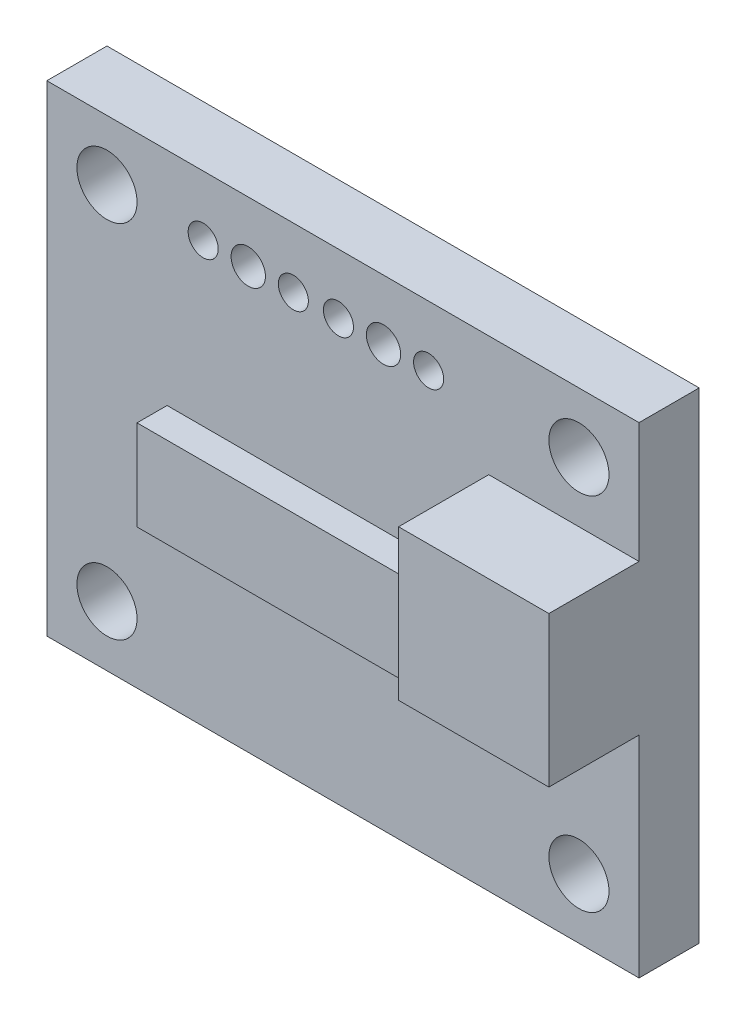
ISO-10303-21;
HEADER;
FILE_DESCRIPTION(('STEP AP214'),'2;1');
FILE_NAME('part.step','',(''),(''),'','','');
FILE_SCHEMA(('AUTOMOTIVE_DESIGN { 1 0 10303 214 1 1 1 1 }'));
ENDSEC;
DATA;
#1=APPLICATION_CONTEXT('core data for automotive mechanical design processes');
#2=APPLICATION_PROTOCOL_DEFINITION('international standard','automotive_design',2000,#1);
#3=PRODUCT_CONTEXT('',#1,'mechanical');
#4=PRODUCT('Part','Part','',(#3));
#5=PRODUCT_RELATED_PRODUCT_CATEGORY('part','',(#4));
#6=PRODUCT_DEFINITION_FORMATION('','',#4);
#7=PRODUCT_DEFINITION_CONTEXT('part definition',#1,'design');
#8=PRODUCT_DEFINITION('design','',#6,#7);
#9=PRODUCT_DEFINITION_SHAPE('','',#8);
#10=(LENGTH_UNIT() NAMED_UNIT(*) SI_UNIT(.MILLI.,.METRE.));
#11=(NAMED_UNIT(*) PLANE_ANGLE_UNIT() SI_UNIT($,.RADIAN.));
#12=(NAMED_UNIT(*) SI_UNIT($,.STERADIAN.) SOLID_ANGLE_UNIT());
#13=UNCERTAINTY_MEASURE_WITH_UNIT(LENGTH_MEASURE(1.E-05),#10,'distance_accuracy_value','');
#14=(GEOMETRIC_REPRESENTATION_CONTEXT(3) GLOBAL_UNCERTAINTY_ASSIGNED_CONTEXT((#13)) GLOBAL_UNIT_ASSIGNED_CONTEXT((#10,
#11,#12)) REPRESENTATION_CONTEXT('',''));
#15=CARTESIAN_POINT('',(0.,0.,0.));
#16=DIRECTION('',(0.,0.,1.));
#17=DIRECTION('',(1.,0.,0.));
#18=AXIS2_PLACEMENT_3D('',#15,#16,#17);
#19=CARTESIAN_POINT('',(0.,7.35633001007277,2.));
#20=DIRECTION('',(0.,-1.,0.));
#21=DIRECTION('',(1.,0.,0.));
#22=AXIS2_PLACEMENT_3D('',#19,#20,#21);
#23=PLANE('',#22);
#24=DIRECTION('',(-1.,0.,0.));
#25=VECTOR('',#24,1.);
#26=CARTESIAN_POINT('',(0.,7.35633001007277,0.));
#27=LINE('',#26,#25);
#28=CARTESIAN_POINT('',(3.5,7.35633001007277,0.));
#29=VERTEX_POINT('',#28);
#30=CARTESIAN_POINT('',(-16.2,7.35633001007277,0.));
#31=VERTEX_POINT('',#30);
#32=EDGE_CURVE('E239',#29,#31,#27,.T.);
#33=ORIENTED_EDGE('',*,*,#32,.T.);
#34=DIRECTION('',(0.,0.,-1.));
#35=VECTOR('',#34,1.);
#36=CARTESIAN_POINT('',(-16.2,7.35633001007277,2.));
#37=LINE('',#36,#35);
#38=CARTESIAN_POINT('',(-16.2,7.35633001007277,2.));
#39=VERTEX_POINT('',#38);
#40=EDGE_CURVE('E50',#39,#31,#37,.T.);
#41=ORIENTED_EDGE('',*,*,#40,.F.);
#42=DIRECTION('',(-1.,0.,0.));
#43=VECTOR('',#42,1.);
#44=CARTESIAN_POINT('',(0.,7.35633001007277,2.));
#45=LINE('',#44,#43);
#46=CARTESIAN_POINT('',(3.5,7.35633001007277,2.));
#47=VERTEX_POINT('',#46);
#48=EDGE_CURVE('E87',#47,#39,#45,.T.);
#49=ORIENTED_EDGE('',*,*,#48,.F.);
#50=DIRECTION('',(0.,0.,-1.));
#51=VECTOR('',#50,1.);
#52=CARTESIAN_POINT('',(3.5,7.35633001007277,2.));
#53=LINE('',#52,#51);
#54=EDGE_CURVE('E11',#47,#29,#53,.T.);
#55=ORIENTED_EDGE('',*,*,#54,.T.);
#56=EDGE_LOOP('',(#33,#41,#49,#55));
#57=FACE_BOUND('',#56,.T.);
#58=ADVANCED_FACE('F41',(#57),#23,.F.);
#59=CARTESIAN_POINT('',(-16.2,0.,2.));
#60=DIRECTION('',(1.,0.,0.));
#61=DIRECTION('',(0.,0.,-1.));
#62=AXIS2_PLACEMENT_3D('',#59,#60,#61);
#63=PLANE('',#62);
#64=DIRECTION('',(0.,-1.,0.));
#65=VECTOR('',#64,1.);
#66=CARTESIAN_POINT('',(-16.2,0.,0.));
#67=LINE('',#66,#65);
#68=CARTESIAN_POINT('',(-16.2,-8.64366998992723,0.));
#69=VERTEX_POINT('',#68);
#70=EDGE_CURVE('E243',#31,#69,#67,.T.);
#71=ORIENTED_EDGE('',*,*,#70,.T.);
#72=DIRECTION('',(0.,0.,-1.));
#73=VECTOR('',#72,1.);
#74=CARTESIAN_POINT('',(-16.2,-8.64366998992723,2.));
#75=LINE('',#74,#73);
#76=CARTESIAN_POINT('',(-16.2,-8.64366998992723,2.));
#77=VERTEX_POINT('',#76);
#78=EDGE_CURVE('E248',#77,#69,#75,.T.);
#79=ORIENTED_EDGE('',*,*,#78,.F.);
#80=DIRECTION('',(0.,-1.,0.));
#81=VECTOR('',#80,1.);
#82=CARTESIAN_POINT('',(-16.2,0.,2.));
#83=LINE('',#82,#81);
#84=EDGE_CURVE('E199',#39,#77,#83,.T.);
#85=ORIENTED_EDGE('',*,*,#84,.F.);
#86=ORIENTED_EDGE('',*,*,#40,.T.);
#87=EDGE_LOOP('',(#71,#79,#85,#86));
#88=FACE_BOUND('',#87,.T.);
#89=ADVANCED_FACE('F251',(#88),#63,.F.);
#90=CARTESIAN_POINT('',(0.,-8.64366998992723,2.));
#91=DIRECTION('',(0.,1.,0.));
#92=DIRECTION('',(0.,0.,1.));
#93=AXIS2_PLACEMENT_3D('',#90,#91,#92);
#94=PLANE('',#93);
#95=DIRECTION('',(1.,0.,0.));
#96=VECTOR('',#95,1.);
#97=CARTESIAN_POINT('',(0.,-8.64366998992723,0.));
#98=LINE('',#97,#96);
#99=CARTESIAN_POINT('',(3.5,-8.64366998992723,0.));
#100=VERTEX_POINT('',#99);
#101=EDGE_CURVE('E75',#69,#100,#98,.T.);
#102=ORIENTED_EDGE('',*,*,#101,.T.);
#103=DIRECTION('',(0.,0.,-1.));
#104=VECTOR('',#103,1.);
#105=CARTESIAN_POINT('',(3.5,-8.64366998992723,2.));
#106=LINE('',#105,#104);
#107=CARTESIAN_POINT('',(3.5,-8.64366998992723,2.));
#108=VERTEX_POINT('',#107);
#109=EDGE_CURVE('E209',#108,#100,#106,.T.);
#110=ORIENTED_EDGE('',*,*,#109,.F.);
#111=DIRECTION('',(1.,0.,0.));
#112=VECTOR('',#111,1.);
#113=CARTESIAN_POINT('',(0.,-8.64366998992723,2.));
#114=LINE('',#113,#112);
#115=EDGE_CURVE('E202',#77,#108,#114,.T.);
#116=ORIENTED_EDGE('',*,*,#115,.F.);
#117=ORIENTED_EDGE('',*,*,#78,.T.);
#118=EDGE_LOOP('',(#102,#110,#116,#117));
#119=FACE_BOUND('',#118,.T.);
#120=ADVANCED_FACE('F275',(#119),#94,.F.);
#121=CARTESIAN_POINT('',(3.5,0.,2.));
#122=DIRECTION('',(-1.,0.,0.));
#123=DIRECTION('',(0.,-1.,0.));
#124=AXIS2_PLACEMENT_3D('',#121,#122,#123);
#125=PLANE('',#124);
#126=DIRECTION('',(0.,1.,0.));
#127=VECTOR('',#126,1.);
#128=CARTESIAN_POINT('',(3.5,0.,0.));
#129=LINE('',#128,#127);
#130=EDGE_CURVE('E79',#100,#29,#129,.T.);
#131=ORIENTED_EDGE('',*,*,#130,.T.);
#132=ORIENTED_EDGE('',*,*,#54,.F.);
#133=DIRECTION('',(0.,1.,0.));
#134=VECTOR('',#133,1.);
#135=CARTESIAN_POINT('',(3.5,0.,2.));
#136=LINE('',#135,#134);
#137=CARTESIAN_POINT('',(3.5,3.35633001007277,2.));
#138=VERTEX_POINT('',#137);
#139=EDGE_CURVE('E195',#138,#47,#136,.T.);
#140=ORIENTED_EDGE('',*,*,#139,.F.);
#141=DIRECTION('',(0.,0.,-1.));
#142=VECTOR('',#141,1.);
#143=CARTESIAN_POINT('',(3.5,3.35633001007277,5.));
#144=LINE('',#143,#142);
#145=CARTESIAN_POINT('',(3.5,3.35633001007277,5.));
#146=VERTEX_POINT('',#145);
#147=EDGE_CURVE('E146',#146,#138,#144,.T.);
#148=ORIENTED_EDGE('',*,*,#147,.F.);
#149=DIRECTION('',(0.,1.,0.));
#150=VECTOR('',#149,1.);
#151=CARTESIAN_POINT('',(3.5,0.,5.));
#152=LINE('',#151,#150);
#153=CARTESIAN_POINT('',(3.5,-1.64366998992723,5.));
#154=VERTEX_POINT('',#153);
#155=EDGE_CURVE('E143',#154,#146,#152,.T.);
#156=ORIENTED_EDGE('',*,*,#155,.F.);
#157=DIRECTION('',(0.,0.,-1.));
#158=VECTOR('',#157,1.);
#159=CARTESIAN_POINT('',(3.5,-1.64366998992723,5.));
#160=LINE('',#159,#158);
#161=CARTESIAN_POINT('',(3.5,-1.64366998992723,2.));
#162=VERTEX_POINT('',#161);
#163=EDGE_CURVE('E149',#154,#162,#160,.T.);
#164=ORIENTED_EDGE('',*,*,#163,.T.);
#165=EDGE_CURVE('E197',#108,#162,#136,.T.);
#166=ORIENTED_EDGE('',*,*,#165,.F.);
#167=ORIENTED_EDGE('',*,*,#109,.T.);
#168=EDGE_LOOP('',(#131,#132,#140,#148,#156,#164,#166,#167));
#169=FACE_BOUND('',#168,.T.);
#170=ADVANCED_FACE('F283',(#169),#125,.F.);
#171=CARTESIAN_POINT('',(-11.,5.35633001007277,2.));
#172=DIRECTION('',(0.,0.,-1.));
#173=DIRECTION('',(-1.,0.,0.));
#174=AXIS2_PLACEMENT_3D('',#171,#172,#173);
#175=CYLINDRICAL_SURFACE('',#174,0.500000000000001);
#176=CARTESIAN_POINT('',(-11.,5.35633001007277,2.));
#177=DIRECTION('',(0.,0.,1.));
#178=DIRECTION('',(1.,0.,0.));
#179=AXIS2_PLACEMENT_3D('',#176,#177,#178);
#180=CIRCLE('',#179,0.500000000000001);
#181=CARTESIAN_POINT('',(-10.5,5.35633001007277,2.));
#182=VERTEX_POINT('',#181);
#183=EDGE_CURVE('E186',#182,#182,#180,.T.);
#184=ORIENTED_EDGE('',*,*,#183,.T.);
#185=EDGE_LOOP('',(#184));
#186=FACE_BOUND('',#185,.T.);
#187=CARTESIAN_POINT('',(-11.,5.35633001007277,0.));
#188=DIRECTION('',(0.,0.,1.));
#189=DIRECTION('',(1.,0.,0.));
#190=AXIS2_PLACEMENT_3D('',#187,#188,#189);
#191=CIRCLE('',#190,0.500000000000001);
#192=CARTESIAN_POINT('',(-10.5,5.35633001007277,0.));
#193=VERTEX_POINT('',#192);
#194=EDGE_CURVE('E236',#193,#193,#191,.T.);
#195=ORIENTED_EDGE('',*,*,#194,.F.);
#196=EDGE_LOOP('',(#195));
#197=FACE_BOUND('',#196,.T.);
#198=ADVANCED_FACE('F279',(#186,#197),#175,.F.);
#199=CARTESIAN_POINT('',(-8.,5.35633001007277,2.));
#200=DIRECTION('',(0.,0.,-1.));
#201=DIRECTION('',(-1.,0.,0.));
#202=AXIS2_PLACEMENT_3D('',#199,#200,#201);
#203=CYLINDRICAL_SURFACE('',#202,0.499999999999999);
#204=CARTESIAN_POINT('',(-8.,5.35633001007277,2.));
#205=DIRECTION('',(0.,0.,1.));
#206=DIRECTION('',(1.,0.,0.));
#207=AXIS2_PLACEMENT_3D('',#204,#205,#206);
#208=CIRCLE('',#207,0.499999999999999);
#209=CARTESIAN_POINT('',(-7.5,5.35633001007277,2.));
#210=VERTEX_POINT('',#209);
#211=EDGE_CURVE('E183',#210,#210,#208,.T.);
#212=ORIENTED_EDGE('',*,*,#211,.T.);
#213=EDGE_LOOP('',(#212));
#214=FACE_BOUND('',#213,.T.);
#215=CARTESIAN_POINT('',(-8.,5.35633001007277,0.));
#216=DIRECTION('',(0.,0.,1.));
#217=DIRECTION('',(1.,0.,0.));
#218=AXIS2_PLACEMENT_3D('',#215,#216,#217);
#219=CIRCLE('',#218,0.499999999999999);
#220=CARTESIAN_POINT('',(-7.5,5.35633001007277,0.));
#221=VERTEX_POINT('',#220);
#222=EDGE_CURVE('E233',#221,#221,#219,.T.);
#223=ORIENTED_EDGE('',*,*,#222,.F.);
#224=EDGE_LOOP('',(#223));
#225=FACE_BOUND('',#224,.T.);
#226=ADVANCED_FACE('F282',(#214,#225),#203,.F.);
#227=CARTESIAN_POINT('',(-9.5,5.35633001007277,2.));
#228=DIRECTION('',(0.,0.,-1.));
#229=DIRECTION('',(-1.,0.,0.));
#230=AXIS2_PLACEMENT_3D('',#227,#228,#229);
#231=CYLINDRICAL_SURFACE('',#230,0.570630300350417);
#232=CARTESIAN_POINT('',(-9.5,5.35633001007277,2.));
#233=DIRECTION('',(0.,0.,1.));
#234=DIRECTION('',(1.,0.,0.));
#235=AXIS2_PLACEMENT_3D('',#232,#233,#234);
#236=CIRCLE('',#235,0.570630300350417);
#237=CARTESIAN_POINT('',(-8.92936969964958,5.35633001007277,2.));
#238=VERTEX_POINT('',#237);
#239=EDGE_CURVE('E180',#238,#238,#236,.T.);
#240=ORIENTED_EDGE('',*,*,#239,.T.);
#241=EDGE_LOOP('',(#240));
#242=FACE_BOUND('',#241,.T.);
#243=CARTESIAN_POINT('',(-9.5,5.35633001007277,0.));
#244=DIRECTION('',(0.,0.,1.));
#245=DIRECTION('',(1.,0.,0.));
#246=AXIS2_PLACEMENT_3D('',#243,#244,#245);
#247=CIRCLE('',#246,0.570630300350417);
#248=CARTESIAN_POINT('',(-8.92936969964958,5.35633001007277,0.));
#249=VERTEX_POINT('',#248);
#250=EDGE_CURVE('E230',#249,#249,#247,.T.);
#251=ORIENTED_EDGE('',*,*,#250,.F.);
#252=EDGE_LOOP('',(#251));
#253=FACE_BOUND('',#252,.T.);
#254=ADVANCED_FACE('F287',(#242,#253),#231,.F.);
#255=CARTESIAN_POINT('',(-6.5,5.35633001007277,2.));
#256=DIRECTION('',(0.,0.,-1.));
#257=DIRECTION('',(-1.,0.,0.));
#258=AXIS2_PLACEMENT_3D('',#255,#256,#257);
#259=CYLINDRICAL_SURFACE('',#258,0.5);
#260=CARTESIAN_POINT('',(-6.5,5.35633001007277,2.));
#261=DIRECTION('',(0.,0.,1.));
#262=DIRECTION('',(1.,0.,0.));
#263=AXIS2_PLACEMENT_3D('',#260,#261,#262);
#264=CIRCLE('',#263,0.5);
#265=CARTESIAN_POINT('',(-6.,5.35633001007277,2.));
#266=VERTEX_POINT('',#265);
#267=EDGE_CURVE('E177',#266,#266,#264,.T.);
#268=ORIENTED_EDGE('',*,*,#267,.T.);
#269=EDGE_LOOP('',(#268));
#270=FACE_BOUND('',#269,.T.);
#271=CARTESIAN_POINT('',(-6.5,5.35633001007277,0.));
#272=DIRECTION('',(0.,0.,1.));
#273=DIRECTION('',(1.,0.,0.));
#274=AXIS2_PLACEMENT_3D('',#271,#272,#273);
#275=CIRCLE('',#274,0.5);
#276=CARTESIAN_POINT('',(-6.,5.35633001007277,0.));
#277=VERTEX_POINT('',#276);
#278=EDGE_CURVE('E227',#277,#277,#275,.T.);
#279=ORIENTED_EDGE('',*,*,#278,.F.);
#280=EDGE_LOOP('',(#279));
#281=FACE_BOUND('',#280,.T.);
#282=ADVANCED_FACE('F291',(#270,#281),#259,.F.);
#283=CARTESIAN_POINT('',(-3.5,5.35633001007277,2.));
#284=DIRECTION('',(0.,0.,-1.));
#285=DIRECTION('',(-1.,0.,0.));
#286=AXIS2_PLACEMENT_3D('',#283,#284,#285);
#287=CYLINDRICAL_SURFACE('',#286,0.499999999999984);
#288=CARTESIAN_POINT('',(-3.5,5.35633001007277,2.));
#289=DIRECTION('',(0.,0.,1.));
#290=DIRECTION('',(1.,0.,0.));
#291=AXIS2_PLACEMENT_3D('',#288,#289,#290);
#292=CIRCLE('',#291,0.499999999999984);
#293=CARTESIAN_POINT('',(-3.00000000000002,5.35633001007277,2.));
#294=VERTEX_POINT('',#293);
#295=EDGE_CURVE('E174',#294,#294,#292,.T.);
#296=ORIENTED_EDGE('',*,*,#295,.T.);
#297=EDGE_LOOP('',(#296));
#298=FACE_BOUND('',#297,.T.);
#299=CARTESIAN_POINT('',(-3.5,5.35633001007277,0.));
#300=DIRECTION('',(0.,0.,1.));
#301=DIRECTION('',(1.,0.,0.));
#302=AXIS2_PLACEMENT_3D('',#299,#300,#301);
#303=CIRCLE('',#302,0.499999999999984);
#304=CARTESIAN_POINT('',(-3.00000000000002,5.35633001007277,0.));
#305=VERTEX_POINT('',#304);
#306=EDGE_CURVE('E224',#305,#305,#303,.T.);
#307=ORIENTED_EDGE('',*,*,#306,.F.);
#308=EDGE_LOOP('',(#307));
#309=FACE_BOUND('',#308,.T.);
#310=ADVANCED_FACE('F295',(#298,#309),#287,.F.);
#311=CARTESIAN_POINT('',(-5.,5.35633001007277,2.));
#312=DIRECTION('',(0.,0.,-1.));
#313=DIRECTION('',(-1.,0.,0.));
#314=AXIS2_PLACEMENT_3D('',#311,#312,#313);
#315=CYLINDRICAL_SURFACE('',#314,0.570630300350417);
#316=CARTESIAN_POINT('',(-5.,5.35633001007277,2.));
#317=DIRECTION('',(0.,0.,1.));
#318=DIRECTION('',(1.,0.,0.));
#319=AXIS2_PLACEMENT_3D('',#316,#317,#318);
#320=CIRCLE('',#319,0.570630300350417);
#321=CARTESIAN_POINT('',(-4.42936969964958,5.35633001007277,2.));
#322=VERTEX_POINT('',#321);
#323=EDGE_CURVE('E171',#322,#322,#320,.T.);
#324=ORIENTED_EDGE('',*,*,#323,.T.);
#325=EDGE_LOOP('',(#324));
#326=FACE_BOUND('',#325,.T.);
#327=CARTESIAN_POINT('',(-5.,5.35633001007277,0.));
#328=DIRECTION('',(0.,0.,1.));
#329=DIRECTION('',(1.,0.,0.));
#330=AXIS2_PLACEMENT_3D('',#327,#328,#329);
#331=CIRCLE('',#330,0.570630300350417);
#332=CARTESIAN_POINT('',(-4.42936969964958,5.35633001007277,0.));
#333=VERTEX_POINT('',#332);
#334=EDGE_CURVE('E221',#333,#333,#331,.T.);
#335=ORIENTED_EDGE('',*,*,#334,.F.);
#336=EDGE_LOOP('',(#335));
#337=FACE_BOUND('',#336,.T.);
#338=ADVANCED_FACE('F299',(#326,#337),#315,.F.);
#339=CARTESIAN_POINT('',(-14.2,5.35633001007277,2.));
#340=DIRECTION('',(0.,0.,-1.));
#341=DIRECTION('',(-1.,0.,0.));
#342=AXIS2_PLACEMENT_3D('',#339,#340,#341);
#343=CYLINDRICAL_SURFACE('',#342,1.);
#344=CARTESIAN_POINT('',(-14.2,5.35633001007277,2.));
#345=DIRECTION('',(0.,0.,1.));
#346=DIRECTION('',(1.,0.,0.));
#347=AXIS2_PLACEMENT_3D('',#344,#345,#346);
#348=CIRCLE('',#347,1.);
#349=CARTESIAN_POINT('',(-13.2,5.35633001007277,2.));
#350=VERTEX_POINT('',#349);
#351=EDGE_CURVE('E168',#350,#350,#348,.T.);
#352=ORIENTED_EDGE('',*,*,#351,.T.);
#353=EDGE_LOOP('',(#352));
#354=FACE_BOUND('',#353,.T.);
#355=CARTESIAN_POINT('',(-14.2,5.35633001007277,0.));
#356=DIRECTION('',(0.,0.,1.));
#357=DIRECTION('',(1.,0.,0.));
#358=AXIS2_PLACEMENT_3D('',#355,#356,#357);
#359=CIRCLE('',#358,1.);
#360=CARTESIAN_POINT('',(-13.2,5.35633001007277,0.));
#361=VERTEX_POINT('',#360);
#362=EDGE_CURVE('E218',#361,#361,#359,.T.);
#363=ORIENTED_EDGE('',*,*,#362,.F.);
#364=EDGE_LOOP('',(#363));
#365=FACE_BOUND('',#364,.T.);
#366=ADVANCED_FACE('F303',(#354,#365),#343,.F.);
#367=CARTESIAN_POINT('',(1.5,5.35633001007277,2.));
#368=DIRECTION('',(0.,0.,-1.));
#369=DIRECTION('',(-1.,0.,0.));
#370=AXIS2_PLACEMENT_3D('',#367,#368,#369);
#371=CYLINDRICAL_SURFACE('',#370,1.);
#372=CARTESIAN_POINT('',(1.5,5.35633001007277,2.));
#373=DIRECTION('',(0.,0.,1.));
#374=DIRECTION('',(1.,0.,0.));
#375=AXIS2_PLACEMENT_3D('',#372,#373,#374);
#376=CIRCLE('',#375,1.);
#377=CARTESIAN_POINT('',(2.5,5.35633001007277,2.));
#378=VERTEX_POINT('',#377);
#379=EDGE_CURVE('E165',#378,#378,#376,.T.);
#380=ORIENTED_EDGE('',*,*,#379,.T.);
#381=EDGE_LOOP('',(#380));
#382=FACE_BOUND('',#381,.T.);
#383=CARTESIAN_POINT('',(1.5,5.35633001007277,0.));
#384=DIRECTION('',(0.,0.,1.));
#385=DIRECTION('',(1.,0.,0.));
#386=AXIS2_PLACEMENT_3D('',#383,#384,#385);
#387=CIRCLE('',#386,1.);
#388=CARTESIAN_POINT('',(2.5,5.35633001007277,0.));
#389=VERTEX_POINT('',#388);
#390=EDGE_CURVE('E215',#389,#389,#387,.T.);
#391=ORIENTED_EDGE('',*,*,#390,.F.);
#392=EDGE_LOOP('',(#391));
#393=FACE_BOUND('',#392,.T.);
#394=ADVANCED_FACE('F307',(#382,#393),#371,.F.);
#395=CARTESIAN_POINT('',(1.5,-6.64366998992723,2.));
#396=DIRECTION('',(0.,0.,-1.));
#397=DIRECTION('',(-1.,0.,0.));
#398=AXIS2_PLACEMENT_3D('',#395,#396,#397);
#399=CYLINDRICAL_SURFACE('',#398,1.);
#400=CARTESIAN_POINT('',(1.5,-6.64366998992723,2.));
#401=DIRECTION('',(0.,0.,1.));
#402=DIRECTION('',(1.,0.,0.));
#403=AXIS2_PLACEMENT_3D('',#400,#401,#402);
#404=CIRCLE('',#403,1.);
#405=CARTESIAN_POINT('',(2.5,-6.64366998992723,2.));
#406=VERTEX_POINT('',#405);
#407=EDGE_CURVE('E162',#406,#406,#404,.T.);
#408=ORIENTED_EDGE('',*,*,#407,.T.);
#409=EDGE_LOOP('',(#408));
#410=FACE_BOUND('',#409,.T.);
#411=CARTESIAN_POINT('',(1.5,-6.64366998992723,0.));
#412=DIRECTION('',(0.,0.,1.));
#413=DIRECTION('',(1.,0.,0.));
#414=AXIS2_PLACEMENT_3D('',#411,#412,#413);
#415=CIRCLE('',#414,1.);
#416=CARTESIAN_POINT('',(2.5,-6.64366998992723,0.));
#417=VERTEX_POINT('',#416);
#418=EDGE_CURVE('E212',#417,#417,#415,.T.);
#419=ORIENTED_EDGE('',*,*,#418,.F.);
#420=EDGE_LOOP('',(#419));
#421=FACE_BOUND('',#420,.T.);
#422=ADVANCED_FACE('F310',(#410,#421),#399,.F.);
#423=CARTESIAN_POINT('',(-14.2,-6.64366998992723,2.));
#424=DIRECTION('',(0.,0.,-1.));
#425=DIRECTION('',(-1.,0.,0.));
#426=AXIS2_PLACEMENT_3D('',#423,#424,#425);
#427=CYLINDRICAL_SURFACE('',#426,1.);
#428=CARTESIAN_POINT('',(-14.2,-6.64366998992723,2.));
#429=DIRECTION('',(0.,0.,1.));
#430=DIRECTION('',(1.,0.,0.));
#431=AXIS2_PLACEMENT_3D('',#428,#429,#430);
#432=CIRCLE('',#431,1.);
#433=CARTESIAN_POINT('',(-13.2,-6.64366998992723,2.));
#434=VERTEX_POINT('',#433);
#435=EDGE_CURVE('E159',#434,#434,#432,.T.);
#436=ORIENTED_EDGE('',*,*,#435,.T.);
#437=EDGE_LOOP('',(#436));
#438=FACE_BOUND('',#437,.T.);
#439=CARTESIAN_POINT('',(-14.2,-6.64366998992723,0.));
#440=DIRECTION('',(0.,0.,1.));
#441=DIRECTION('',(1.,0.,0.));
#442=AXIS2_PLACEMENT_3D('',#439,#440,#441);
#443=CIRCLE('',#442,1.);
#444=CARTESIAN_POINT('',(-13.2,-6.64366998992723,0.));
#445=VERTEX_POINT('',#444);
#446=EDGE_CURVE('E158',#445,#445,#443,.T.);
#447=ORIENTED_EDGE('',*,*,#446,.F.);
#448=EDGE_LOOP('',(#447));
#449=FACE_BOUND('',#448,.T.);
#450=ADVANCED_FACE('F43',(#438,#449),#427,.F.);
#451=CARTESIAN_POINT('',(0.,0.,2.));
#452=DIRECTION('',(0.,0.,1.));
#453=DIRECTION('',(1.,0.,0.));
#454=AXIS2_PLACEMENT_3D('',#451,#452,#453);
#455=PLANE('',#454);
#456=ORIENTED_EDGE('',*,*,#435,.F.);
#457=EDGE_LOOP('',(#456));
#458=FACE_BOUND('',#457,.T.);
#459=ORIENTED_EDGE('',*,*,#407,.F.);
#460=EDGE_LOOP('',(#459));
#461=FACE_BOUND('',#460,.T.);
#462=ORIENTED_EDGE('',*,*,#379,.F.);
#463=EDGE_LOOP('',(#462));
#464=FACE_BOUND('',#463,.T.);
#465=ORIENTED_EDGE('',*,*,#351,.F.);
#466=EDGE_LOOP('',(#465));
#467=FACE_BOUND('',#466,.T.);
#468=ORIENTED_EDGE('',*,*,#323,.F.);
#469=EDGE_LOOP('',(#468));
#470=FACE_BOUND('',#469,.T.);
#471=ORIENTED_EDGE('',*,*,#295,.F.);
#472=EDGE_LOOP('',(#471));
#473=FACE_BOUND('',#472,.T.);
#474=ORIENTED_EDGE('',*,*,#267,.F.);
#475=EDGE_LOOP('',(#474));
#476=FACE_BOUND('',#475,.T.);
#477=ORIENTED_EDGE('',*,*,#239,.F.);
#478=EDGE_LOOP('',(#477));
#479=FACE_BOUND('',#478,.T.);
#480=ORIENTED_EDGE('',*,*,#211,.F.);
#481=EDGE_LOOP('',(#480));
#482=FACE_BOUND('',#481,.T.);
#483=ORIENTED_EDGE('',*,*,#183,.F.);
#484=EDGE_LOOP('',(#483));
#485=FACE_BOUND('',#484,.T.);
#486=DIRECTION('',(0.,-1.,0.));
#487=VECTOR('',#486,1.);
#488=CARTESIAN_POINT('',(-1.5,0.,2.));
#489=LINE('',#488,#487);
#490=CARTESIAN_POINT('',(-1.5,3.35633001007277,2.));
#491=VERTEX_POINT('',#490);
#492=CARTESIAN_POINT('',(-1.5,-1.64366998992723,2.));
#493=VERTEX_POINT('',#492);
#494=EDGE_CURVE('E189',#491,#493,#489,.T.);
#495=ORIENTED_EDGE('',*,*,#494,.F.);
#496=DIRECTION('',(-1.,0.,0.));
#497=VECTOR('',#496,1.);
#498=CARTESIAN_POINT('',(0.,3.35633001007277,2.));
#499=LINE('',#498,#497);
#500=EDGE_CURVE('E192',#138,#491,#499,.T.);
#501=ORIENTED_EDGE('',*,*,#500,.F.);
#502=ORIENTED_EDGE('',*,*,#139,.T.);
#503=ORIENTED_EDGE('',*,*,#48,.T.);
#504=ORIENTED_EDGE('',*,*,#84,.T.);
#505=ORIENTED_EDGE('',*,*,#115,.T.);
#506=ORIENTED_EDGE('',*,*,#165,.T.);
#507=DIRECTION('',(1.,0.,0.));
#508=VECTOR('',#507,1.);
#509=CARTESIAN_POINT('',(0.,-1.64366998992723,2.));
#510=LINE('',#509,#508);
#511=EDGE_CURVE('E110',#493,#162,#510,.T.);
#512=ORIENTED_EDGE('',*,*,#511,.F.);
#513=EDGE_LOOP('',(#495,#501,#502,#503,#504,#505,#506,#512));
#514=FACE_BOUND('',#513,.T.);
#515=DIRECTION('',(0.,-1.,0.));
#516=VECTOR('',#515,1.);
#517=CARTESIAN_POINT('',(-2.2,0.,2.));
#518=LINE('',#517,#516);
#519=CARTESIAN_POINT('',(-2.2,0.,2.));
#520=VERTEX_POINT('',#519);
#521=CARTESIAN_POINT('',(-2.2,-3.,2.));
#522=VERTEX_POINT('',#521);
#523=EDGE_CURVE('E100',#520,#522,#518,.T.);
#524=ORIENTED_EDGE('',*,*,#523,.T.);
#525=DIRECTION('',(-1.,0.,0.));
#526=VECTOR('',#525,1.);
#527=CARTESIAN_POINT('',(0.,-3.,2.));
#528=LINE('',#527,#526);
#529=CARTESIAN_POINT('',(-12.2,-3.,2.));
#530=VERTEX_POINT('',#529);
#531=EDGE_CURVE('E104',#522,#530,#528,.T.);
#532=ORIENTED_EDGE('',*,*,#531,.T.);
#533=DIRECTION('',(0.,-1.,0.));
#534=VECTOR('',#533,1.);
#535=CARTESIAN_POINT('',(-12.2,0.,2.));
#536=LINE('',#535,#534);
#537=CARTESIAN_POINT('',(-12.2,0.,2.));
#538=VERTEX_POINT('',#537);
#539=EDGE_CURVE('E122',#538,#530,#536,.T.);
#540=ORIENTED_EDGE('',*,*,#539,.F.);
#541=DIRECTION('',(1.,0.,0.));
#542=VECTOR('',#541,1.);
#543=CARTESIAN_POINT('',(0.,0.,2.));
#544=LINE('',#543,#542);
#545=EDGE_CURVE('E58',#538,#520,#544,.T.);
#546=ORIENTED_EDGE('',*,*,#545,.T.);
#547=EDGE_LOOP('',(#524,#532,#540,#546));
#548=FACE_BOUND('',#547,.T.);
#549=ADVANCED_FACE('F102',(#458,#461,#464,#467,#470,#473,#476,#479,#482,#485,#514,#548),#455,.T.);
#550=CARTESIAN_POINT('',(0.,0.,0.));
#551=DIRECTION('',(0.,0.,1.));
#552=DIRECTION('',(1.,0.,0.));
#553=AXIS2_PLACEMENT_3D('',#550,#551,#552);
#554=PLANE('',#553);
#555=ORIENTED_EDGE('',*,*,#446,.T.);
#556=EDGE_LOOP('',(#555));
#557=FACE_BOUND('',#556,.T.);
#558=ORIENTED_EDGE('',*,*,#418,.T.);
#559=EDGE_LOOP('',(#558));
#560=FACE_BOUND('',#559,.T.);
#561=ORIENTED_EDGE('',*,*,#390,.T.);
#562=EDGE_LOOP('',(#561));
#563=FACE_BOUND('',#562,.T.);
#564=ORIENTED_EDGE('',*,*,#362,.T.);
#565=EDGE_LOOP('',(#564));
#566=FACE_BOUND('',#565,.T.);
#567=ORIENTED_EDGE('',*,*,#334,.T.);
#568=EDGE_LOOP('',(#567));
#569=FACE_BOUND('',#568,.T.);
#570=ORIENTED_EDGE('',*,*,#306,.T.);
#571=EDGE_LOOP('',(#570));
#572=FACE_BOUND('',#571,.T.);
#573=ORIENTED_EDGE('',*,*,#278,.T.);
#574=EDGE_LOOP('',(#573));
#575=FACE_BOUND('',#574,.T.);
#576=ORIENTED_EDGE('',*,*,#250,.T.);
#577=EDGE_LOOP('',(#576));
#578=FACE_BOUND('',#577,.T.);
#579=ORIENTED_EDGE('',*,*,#222,.T.);
#580=EDGE_LOOP('',(#579));
#581=FACE_BOUND('',#580,.T.);
#582=ORIENTED_EDGE('',*,*,#194,.T.);
#583=EDGE_LOOP('',(#582));
#584=FACE_BOUND('',#583,.T.);
#585=ORIENTED_EDGE('',*,*,#32,.F.);
#586=ORIENTED_EDGE('',*,*,#130,.F.);
#587=ORIENTED_EDGE('',*,*,#101,.F.);
#588=ORIENTED_EDGE('',*,*,#70,.F.);
#589=EDGE_LOOP('',(#585,#586,#587,#588));
#590=FACE_BOUND('',#589,.T.);
#591=ADVANCED_FACE('F254',(#557,#560,#563,#566,#569,#572,#575,#578,#581,#584,#590),#554,.F.);
#592=CARTESIAN_POINT('',(0.,3.35633001007277,5.));
#593=DIRECTION('',(0.,-1.,0.));
#594=DIRECTION('',(1.,0.,0.));
#595=AXIS2_PLACEMENT_3D('',#592,#593,#594);
#596=PLANE('',#595);
#597=ORIENTED_EDGE('',*,*,#500,.T.);
#598=DIRECTION('',(0.,0.,-1.));
#599=VECTOR('',#598,1.);
#600=CARTESIAN_POINT('',(-1.5,3.35633001007277,5.));
#601=LINE('',#600,#599);
#602=CARTESIAN_POINT('',(-1.5,3.35633001007277,5.));
#603=VERTEX_POINT('',#602);
#604=EDGE_CURVE('E155',#603,#491,#601,.T.);
#605=ORIENTED_EDGE('',*,*,#604,.F.);
#606=DIRECTION('',(-1.,0.,0.));
#607=VECTOR('',#606,1.);
#608=CARTESIAN_POINT('',(0.,3.35633001007277,5.));
#609=LINE('',#608,#607);
#610=EDGE_CURVE('E128',#146,#603,#609,.T.);
#611=ORIENTED_EDGE('',*,*,#610,.F.);
#612=ORIENTED_EDGE('',*,*,#147,.T.);
#613=EDGE_LOOP('',(#597,#605,#611,#612));
#614=FACE_BOUND('',#613,.T.);
#615=ADVANCED_FACE('F256',(#614),#596,.F.);
#616=CARTESIAN_POINT('',(-1.5,0.,5.));
#617=DIRECTION('',(1.,0.,0.));
#618=DIRECTION('',(0.,1.,0.));
#619=AXIS2_PLACEMENT_3D('',#616,#617,#618);
#620=PLANE('',#619);
#621=ORIENTED_EDGE('',*,*,#494,.T.);
#622=DIRECTION('',(0.,0.,-1.));
#623=VECTOR('',#622,1.);
#624=CARTESIAN_POINT('',(-1.5,-1.64366998992723,5.));
#625=LINE('',#624,#623);
#626=CARTESIAN_POINT('',(-1.5,-1.64366998992723,5.));
#627=VERTEX_POINT('',#626);
#628=EDGE_CURVE('E152',#627,#493,#625,.T.);
#629=ORIENTED_EDGE('',*,*,#628,.F.);
#630=DIRECTION('',(0.,-1.,0.));
#631=VECTOR('',#630,1.);
#632=CARTESIAN_POINT('',(-1.5,0.,5.));
#633=LINE('',#632,#631);
#634=EDGE_CURVE('E132',#603,#627,#633,.T.);
#635=ORIENTED_EDGE('',*,*,#634,.F.);
#636=ORIENTED_EDGE('',*,*,#604,.T.);
#637=EDGE_LOOP('',(#621,#629,#635,#636));
#638=FACE_BOUND('',#637,.T.);
#639=ADVANCED_FACE('F263',(#638),#620,.F.);
#640=CARTESIAN_POINT('',(0.,-1.64366998992723,5.));
#641=DIRECTION('',(0.,1.,0.));
#642=DIRECTION('',(-1.,0.,0.));
#643=AXIS2_PLACEMENT_3D('',#640,#641,#642);
#644=PLANE('',#643);
#645=ORIENTED_EDGE('',*,*,#511,.T.);
#646=ORIENTED_EDGE('',*,*,#163,.F.);
#647=DIRECTION('',(1.,0.,0.));
#648=VECTOR('',#647,1.);
#649=CARTESIAN_POINT('',(0.,-1.64366998992723,5.));
#650=LINE('',#649,#648);
#651=EDGE_CURVE('E140',#627,#154,#650,.T.);
#652=ORIENTED_EDGE('',*,*,#651,.F.);
#653=ORIENTED_EDGE('',*,*,#628,.T.);
#654=EDGE_LOOP('',(#645,#646,#652,#653));
#655=FACE_BOUND('',#654,.T.);
#656=ADVANCED_FACE('F377',(#655),#644,.F.);
#657=CARTESIAN_POINT('',(0.,0.,5.));
#658=DIRECTION('',(0.,0.,1.));
#659=DIRECTION('',(1.,0.,0.));
#660=AXIS2_PLACEMENT_3D('',#657,#658,#659);
#661=PLANE('',#660);
#662=ORIENTED_EDGE('',*,*,#610,.T.);
#663=ORIENTED_EDGE('',*,*,#634,.T.);
#664=ORIENTED_EDGE('',*,*,#651,.T.);
#665=ORIENTED_EDGE('',*,*,#155,.T.);
#666=EDGE_LOOP('',(#662,#663,#664,#665));
#667=FACE_BOUND('',#666,.T.);
#668=ADVANCED_FACE('F384',(#667),#661,.T.);
#669=CARTESIAN_POINT('',(0.,-3.,3.));
#670=DIRECTION('',(0.,-1.,0.));
#671=DIRECTION('',(1.,0.,0.));
#672=AXIS2_PLACEMENT_3D('',#669,#670,#671);
#673=PLANE('',#672);
#674=DIRECTION('',(0.,0.,-1.));
#675=VECTOR('',#674,1.);
#676=CARTESIAN_POINT('',(-12.2,-3.,3.));
#677=LINE('',#676,#675);
#678=CARTESIAN_POINT('',(-12.2,-3.,3.));
#679=VERTEX_POINT('',#678);
#680=EDGE_CURVE('E121',#679,#530,#677,.T.);
#681=ORIENTED_EDGE('',*,*,#680,.T.);
#682=ORIENTED_EDGE('',*,*,#531,.F.);
#683=DIRECTION('',(0.,0.,-1.));
#684=VECTOR('',#683,1.);
#685=CARTESIAN_POINT('',(-2.2,-3.,3.));
#686=LINE('',#685,#684);
#687=CARTESIAN_POINT('',(-2.2,-3.,3.));
#688=VERTEX_POINT('',#687);
#689=EDGE_CURVE('E118',#688,#522,#686,.T.);
#690=ORIENTED_EDGE('',*,*,#689,.F.);
#691=DIRECTION('',(-1.,0.,0.));
#692=VECTOR('',#691,1.);
#693=CARTESIAN_POINT('',(0.,-3.,3.));
#694=LINE('',#693,#692);
#695=EDGE_CURVE('E620',#688,#679,#694,.T.);
#696=ORIENTED_EDGE('',*,*,#695,.T.);
#697=EDGE_LOOP('',(#681,#682,#690,#696));
#698=FACE_BOUND('',#697,.T.);
#699=ADVANCED_FACE('F115',(#698),#673,.T.);
#700=CARTESIAN_POINT('',(-2.2,0.,3.));
#701=DIRECTION('',(1.,0.,0.));
#702=DIRECTION('',(0.,1.,0.));
#703=AXIS2_PLACEMENT_3D('',#700,#701,#702);
#704=PLANE('',#703);
#705=ORIENTED_EDGE('',*,*,#689,.T.);
#706=ORIENTED_EDGE('',*,*,#523,.F.);
#707=DIRECTION('',(0.,0.,-1.));
#708=VECTOR('',#707,1.);
#709=CARTESIAN_POINT('',(-2.2,0.,3.));
#710=LINE('',#709,#708);
#711=CARTESIAN_POINT('',(-2.2,0.,3.));
#712=VERTEX_POINT('',#711);
#713=EDGE_CURVE('E129',#712,#520,#710,.T.);
#714=ORIENTED_EDGE('',*,*,#713,.F.);
#715=DIRECTION('',(0.,-1.,0.));
#716=VECTOR('',#715,1.);
#717=CARTESIAN_POINT('',(-2.2,0.,3.));
#718=LINE('',#717,#716);
#719=EDGE_CURVE('E127',#712,#688,#718,.T.);
#720=ORIENTED_EDGE('',*,*,#719,.T.);
#721=EDGE_LOOP('',(#705,#706,#714,#720));
#722=FACE_BOUND('',#721,.T.);
#723=ADVANCED_FACE('F125',(#722),#704,.T.);
#724=CARTESIAN_POINT('',(0.,0.,3.));
#725=DIRECTION('',(0.,1.,0.));
#726=DIRECTION('',(0.,0.,1.));
#727=AXIS2_PLACEMENT_3D('',#724,#725,#726);
#728=PLANE('',#727);
#729=ORIENTED_EDGE('',*,*,#713,.T.);
#730=ORIENTED_EDGE('',*,*,#545,.F.);
#731=DIRECTION('',(0.,0.,-1.));
#732=VECTOR('',#731,1.);
#733=CARTESIAN_POINT('',(-12.2,0.,3.));
#734=LINE('',#733,#732);
#735=CARTESIAN_POINT('',(-12.2,0.,3.));
#736=VERTEX_POINT('',#735);
#737=EDGE_CURVE('E134',#736,#538,#734,.T.);
#738=ORIENTED_EDGE('',*,*,#737,.F.);
#739=DIRECTION('',(1.,0.,0.));
#740=VECTOR('',#739,1.);
#741=CARTESIAN_POINT('',(0.,0.,3.));
#742=LINE('',#741,#740);
#743=EDGE_CURVE('E629',#736,#712,#742,.T.);
#744=ORIENTED_EDGE('',*,*,#743,.T.);
#745=EDGE_LOOP('',(#729,#730,#738,#744));
#746=FACE_BOUND('',#745,.T.);
#747=ADVANCED_FACE('F488',(#746),#728,.T.);
#748=CARTESIAN_POINT('',(-12.2,0.,3.));
#749=DIRECTION('',(1.,0.,0.));
#750=DIRECTION('',(0.,1.,0.));
#751=AXIS2_PLACEMENT_3D('',#748,#749,#750);
#752=PLANE('',#751);
#753=ORIENTED_EDGE('',*,*,#539,.T.);
#754=ORIENTED_EDGE('',*,*,#680,.F.);
#755=DIRECTION('',(0.,-1.,0.));
#756=VECTOR('',#755,1.);
#757=CARTESIAN_POINT('',(-12.2,0.,3.));
#758=LINE('',#757,#756);
#759=EDGE_CURVE('E626',#736,#679,#758,.T.);
#760=ORIENTED_EDGE('',*,*,#759,.F.);
#761=ORIENTED_EDGE('',*,*,#737,.T.);
#762=EDGE_LOOP('',(#753,#754,#760,#761));
#763=FACE_BOUND('',#762,.T.);
#764=ADVANCED_FACE('F497',(#763),#752,.F.);
#765=CARTESIAN_POINT('',(0.,0.,3.));
#766=DIRECTION('',(0.,0.,1.));
#767=DIRECTION('',(1.,0.,0.));
#768=AXIS2_PLACEMENT_3D('',#765,#766,#767);
#769=PLANE('',#768);
#770=ORIENTED_EDGE('',*,*,#695,.F.);
#771=ORIENTED_EDGE('',*,*,#719,.F.);
#772=ORIENTED_EDGE('',*,*,#743,.F.);
#773=ORIENTED_EDGE('',*,*,#759,.T.);
#774=EDGE_LOOP('',(#770,#771,#772,#773));
#775=FACE_BOUND('',#774,.T.);
#776=ADVANCED_FACE('F507',(#775),#769,.T.);
#777=CLOSED_SHELL('',(#58,#89,#120,#170,#198,#226,#254,#282,#310,#338,#366,#394,#422,#450,#549,
#591,#615,#639,#656,#668,#699,#723,#747,#764,#776));
#778=MANIFOLD_SOLID_BREP('B2',#777);
#779=ADVANCED_BREP_SHAPE_REPRESENTATION('',(#18,#778),#14);
#780=SHAPE_DEFINITION_REPRESENTATION(#9,#779);
ENDSEC;
END-ISO-10303-21;
